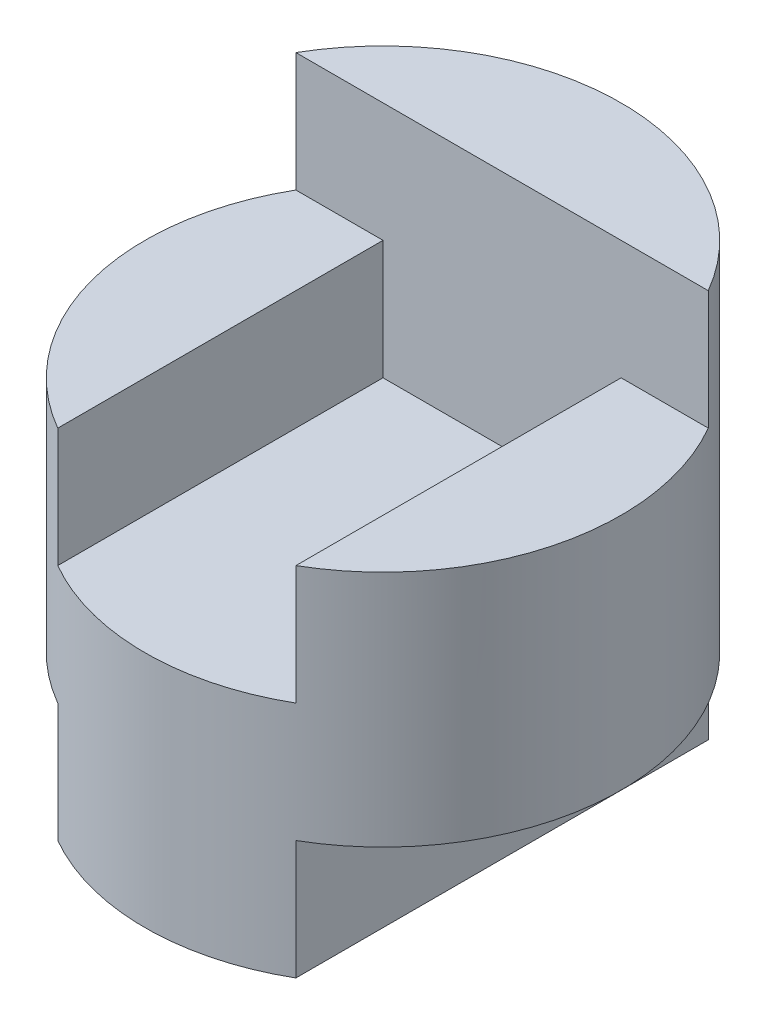
ISO-10303-21;
HEADER;
FILE_DESCRIPTION(('STEP AP214'),'2;1');
FILE_NAME('part.step','',(''),(''),'','','');
FILE_SCHEMA(('AUTOMOTIVE_DESIGN { 1 0 10303 214 1 1 1 1 }'));
ENDSEC;
DATA;
#1=APPLICATION_CONTEXT('core data for automotive mechanical design processes');
#2=APPLICATION_PROTOCOL_DEFINITION('international standard','automotive_design',2000,#1);
#3=PRODUCT_CONTEXT('',#1,'mechanical');
#4=PRODUCT('Part','Part','',(#3));
#5=PRODUCT_RELATED_PRODUCT_CATEGORY('part','',(#4));
#6=PRODUCT_DEFINITION_FORMATION('','',#4);
#7=PRODUCT_DEFINITION_CONTEXT('part definition',#1,'design');
#8=PRODUCT_DEFINITION('design','',#6,#7);
#9=PRODUCT_DEFINITION_SHAPE('','',#8);
#10=(LENGTH_UNIT() NAMED_UNIT(*) SI_UNIT(.MILLI.,.METRE.));
#11=(NAMED_UNIT(*) PLANE_ANGLE_UNIT() SI_UNIT($,.RADIAN.));
#12=(NAMED_UNIT(*) SI_UNIT($,.STERADIAN.) SOLID_ANGLE_UNIT());
#13=UNCERTAINTY_MEASURE_WITH_UNIT(LENGTH_MEASURE(1.E-05),#10,'distance_accuracy_value','');
#14=(GEOMETRIC_REPRESENTATION_CONTEXT(3) GLOBAL_UNCERTAINTY_ASSIGNED_CONTEXT((#13)) GLOBAL_UNIT_ASSIGNED_CONTEXT((#10,
#11,#12)) REPRESENTATION_CONTEXT('',''));
#15=CARTESIAN_POINT('',(0.,0.,0.));
#16=DIRECTION('',(0.,0.,1.));
#17=DIRECTION('',(1.,0.,0.));
#18=AXIS2_PLACEMENT_3D('',#15,#16,#17);
#19=CARTESIAN_POINT('',(0.,4.,0.));
#20=DIRECTION('',(0.,-1.,0.));
#21=DIRECTION('',(0.,0.,-1.));
#22=AXIS2_PLACEMENT_3D('',#19,#20,#21);
#23=CYLINDRICAL_SURFACE('',#22,2.);
#24=CARTESIAN_POINT('',(0.,1.,0.));
#25=DIRECTION('',(0.,1.,0.));
#26=DIRECTION('',(0.,0.,1.));
#27=AXIS2_PLACEMENT_3D('',#24,#25,#26);
#28=CIRCLE('',#27,2.);
#29=CARTESIAN_POINT('',(-1.,1.,-1.73205080756888));
#30=VERTEX_POINT('',#29);
#31=CARTESIAN_POINT('',(-1.,1.,1.73205080756888));
#32=VERTEX_POINT('',#31);
#33=EDGE_CURVE('E178',#30,#32,#28,.T.);
#34=ORIENTED_EDGE('',*,*,#33,.T.);
#35=DIRECTION('',(0.,-1.,0.));
#36=VECTOR('',#35,1.);
#37=CARTESIAN_POINT('',(-1.,4.,1.73205080756888));
#38=LINE('',#37,#36);
#39=CARTESIAN_POINT('',(-1.,0.,1.73205080756888));
#40=VERTEX_POINT('',#39);
#41=EDGE_CURVE('E160',#32,#40,#38,.T.);
#42=ORIENTED_EDGE('',*,*,#41,.T.);
#43=CARTESIAN_POINT('',(0.,0.,0.));
#44=DIRECTION('',(0.,1.,0.));
#45=DIRECTION('',(0.,0.,1.));
#46=AXIS2_PLACEMENT_3D('',#43,#44,#45);
#47=CIRCLE('',#46,2.);
#48=CARTESIAN_POINT('',(1.,0.,1.73205080756888));
#49=VERTEX_POINT('',#48);
#50=EDGE_CURVE('E163',#40,#49,#47,.T.);
#51=ORIENTED_EDGE('',*,*,#50,.T.);
#52=DIRECTION('',(0.,-1.,0.));
#53=VECTOR('',#52,1.);
#54=CARTESIAN_POINT('',(1.,4.,1.73205080756888));
#55=LINE('',#54,#53);
#56=CARTESIAN_POINT('',(1.,1.,1.73205080756888));
#57=VERTEX_POINT('',#56);
#58=EDGE_CURVE('E151',#49,#57,#55,.F.);
#59=ORIENTED_EDGE('',*,*,#58,.T.);
#60=CARTESIAN_POINT('',(0.,1.,0.));
#61=DIRECTION('',(0.,1.,0.));
#62=DIRECTION('',(0.,0.,1.));
#63=AXIS2_PLACEMENT_3D('',#60,#61,#62);
#64=CIRCLE('',#63,2.);
#65=CARTESIAN_POINT('',(1.,1.,-1.73205080756888));
#66=VERTEX_POINT('',#65);
#67=EDGE_CURVE('E175',#57,#66,#64,.T.);
#68=ORIENTED_EDGE('',*,*,#67,.T.);
#69=DIRECTION('',(0.,-1.,0.));
#70=VECTOR('',#69,1.);
#71=CARTESIAN_POINT('',(1.,4.,-1.73205080756888));
#72=LINE('',#71,#70);
#73=CARTESIAN_POINT('',(1.,0.,-1.73205080756888));
#74=VERTEX_POINT('',#73);
#75=EDGE_CURVE('E156',#66,#74,#72,.T.);
#76=ORIENTED_EDGE('',*,*,#75,.T.);
#77=CARTESIAN_POINT('',(-1.,0.,-1.73205080756888));
#78=VERTEX_POINT('',#77);
#79=EDGE_CURVE('E168',#74,#78,#47,.T.);
#80=ORIENTED_EDGE('',*,*,#79,.T.);
#81=DIRECTION('',(0.,-1.,0.));
#82=VECTOR('',#81,1.);
#83=CARTESIAN_POINT('',(-1.,4.,-1.73205080756888));
#84=LINE('',#83,#82);
#85=EDGE_CURVE('E55',#78,#30,#84,.F.);
#86=ORIENTED_EDGE('',*,*,#85,.T.);
#87=EDGE_LOOP('',(#34,#42,#51,#59,#68,#76,#80,#86));
#88=FACE_BOUND('',#87,.T.);
#89=DIRECTION('',(0.,-1.,0.));
#90=VECTOR('',#89,1.);
#91=CARTESIAN_POINT('',(1.73205080756888,4.,-1.));
#92=LINE('',#91,#90);
#93=CARTESIAN_POINT('',(1.73205080756888,4.,-1.));
#94=VERTEX_POINT('',#93);
#95=CARTESIAN_POINT('',(1.73205080756888,3.,-1.));
#96=VERTEX_POINT('',#95);
#97=EDGE_CURVE('E47',#94,#96,#92,.T.);
#98=ORIENTED_EDGE('',*,*,#97,.T.);
#99=CARTESIAN_POINT('',(0.,3.,0.));
#100=DIRECTION('',(0.,1.,0.));
#101=DIRECTION('',(0.,0.,1.));
#102=AXIS2_PLACEMENT_3D('',#99,#100,#101);
#103=CIRCLE('',#102,2.);
#104=CARTESIAN_POINT('',(1.,3.,1.73205080756888));
#105=VERTEX_POINT('',#104);
#106=EDGE_CURVE('E11',#105,#96,#103,.T.);
#107=ORIENTED_EDGE('',*,*,#106,.F.);
#108=DIRECTION('',(0.,-1.,0.));
#109=VECTOR('',#108,1.);
#110=CARTESIAN_POINT('',(1.,4.,1.73205080756888));
#111=LINE('',#110,#109);
#112=CARTESIAN_POINT('',(1.,2.,1.73205080756888));
#113=VERTEX_POINT('',#112);
#114=EDGE_CURVE('E40',#113,#105,#111,.F.);
#115=ORIENTED_EDGE('',*,*,#114,.F.);
#116=CARTESIAN_POINT('',(0.,2.,0.));
#117=DIRECTION('',(0.,1.,0.));
#118=DIRECTION('',(-1.,0.,0.));
#119=AXIS2_PLACEMENT_3D('',#116,#117,#118);
#120=CIRCLE('',#119,2.);
#121=CARTESIAN_POINT('',(-1.,2.,1.73205080756888));
#122=VERTEX_POINT('',#121);
#123=EDGE_CURVE('E185',#122,#113,#120,.T.);
#124=ORIENTED_EDGE('',*,*,#123,.F.);
#125=DIRECTION('',(0.,-1.,0.));
#126=VECTOR('',#125,1.);
#127=CARTESIAN_POINT('',(-1.,4.,1.73205080756888));
#128=LINE('',#127,#126);
#129=CARTESIAN_POINT('',(-1.,3.,1.73205080756888));
#130=VERTEX_POINT('',#129);
#131=EDGE_CURVE('E183',#130,#122,#128,.T.);
#132=ORIENTED_EDGE('',*,*,#131,.F.);
#133=CARTESIAN_POINT('',(0.,3.,0.));
#134=DIRECTION('',(0.,1.,0.));
#135=DIRECTION('',(-1.,0.,0.));
#136=AXIS2_PLACEMENT_3D('',#133,#134,#135);
#137=CIRCLE('',#136,2.);
#138=CARTESIAN_POINT('',(-1.73205080756888,3.,-1.));
#139=VERTEX_POINT('',#138);
#140=EDGE_CURVE('E115',#139,#130,#137,.T.);
#141=ORIENTED_EDGE('',*,*,#140,.F.);
#142=DIRECTION('',(0.,-1.,0.));
#143=VECTOR('',#142,1.);
#144=CARTESIAN_POINT('',(-1.73205080756888,4.,-1.));
#145=LINE('',#144,#143);
#146=CARTESIAN_POINT('',(-1.73205080756888,4.,-1.));
#147=VERTEX_POINT('',#146);
#148=EDGE_CURVE('E119',#139,#147,#145,.F.);
#149=ORIENTED_EDGE('',*,*,#148,.T.);
#150=CARTESIAN_POINT('',(0.,4.,0.));
#151=DIRECTION('',(0.,1.,0.));
#152=DIRECTION('',(0.,0.,1.));
#153=AXIS2_PLACEMENT_3D('',#150,#151,#152);
#154=CIRCLE('',#153,2.);
#155=EDGE_CURVE('E164',#94,#147,#154,.T.);
#156=ORIENTED_EDGE('',*,*,#155,.F.);
#157=EDGE_LOOP('',(#98,#107,#115,#124,#132,#141,#149,#156));
#158=FACE_BOUND('',#157,.T.);
#159=ADVANCED_FACE('F33',(#88,#158),#23,.T.);
#160=CARTESIAN_POINT('',(0.,4.,0.));
#161=DIRECTION('',(0.,1.,0.));
#162=DIRECTION('',(0.,0.,1.));
#163=AXIS2_PLACEMENT_3D('',#160,#161,#162);
#164=PLANE('',#163);
#165=DIRECTION('',(-1.,0.,0.));
#166=VECTOR('',#165,1.);
#167=CARTESIAN_POINT('',(0.,4.,-1.));
#168=LINE('',#167,#166);
#169=EDGE_CURVE('E180',#94,#147,#168,.T.);
#170=ORIENTED_EDGE('',*,*,#169,.F.);
#171=ORIENTED_EDGE('',*,*,#155,.T.);
#172=EDGE_LOOP('',(#170,#171));
#173=FACE_BOUND('',#172,.T.);
#174=ADVANCED_FACE('F200',(#173),#164,.T.);
#175=CARTESIAN_POINT('',(0.,0.,0.));
#176=DIRECTION('',(0.,1.,0.));
#177=DIRECTION('',(0.,0.,1.));
#178=AXIS2_PLACEMENT_3D('',#175,#176,#177);
#179=PLANE('',#178);
#180=ORIENTED_EDGE('',*,*,#50,.F.);
#181=DIRECTION('',(0.,0.,-1.));
#182=VECTOR('',#181,1.);
#183=CARTESIAN_POINT('',(-1.,0.,0.));
#184=LINE('',#183,#182);
#185=EDGE_CURVE('E173',#40,#78,#184,.T.);
#186=ORIENTED_EDGE('',*,*,#185,.T.);
#187=ORIENTED_EDGE('',*,*,#79,.F.);
#188=DIRECTION('',(0.,0.,1.));
#189=VECTOR('',#188,1.);
#190=CARTESIAN_POINT('',(1.,0.,0.));
#191=LINE('',#190,#189);
#192=EDGE_CURVE('E167',#74,#49,#191,.T.);
#193=ORIENTED_EDGE('',*,*,#192,.T.);
#194=EDGE_LOOP('',(#180,#186,#187,#193));
#195=FACE_BOUND('',#194,.T.);
#196=ADVANCED_FACE('F202',(#195),#179,.F.);
#197=CARTESIAN_POINT('',(2.,1.,-2.));
#198=DIRECTION('',(0.,1.,0.));
#199=DIRECTION('',(0.,0.,1.));
#200=AXIS2_PLACEMENT_3D('',#197,#198,#199);
#201=PLANE('',#200);
#202=DIRECTION('',(0.,0.,1.));
#203=VECTOR('',#202,1.);
#204=CARTESIAN_POINT('',(1.,1.,-2.));
#205=LINE('',#204,#203);
#206=EDGE_CURVE('E147',#66,#57,#205,.T.);
#207=ORIENTED_EDGE('',*,*,#206,.F.);
#208=ORIENTED_EDGE('',*,*,#67,.F.);
#209=EDGE_LOOP('',(#207,#208));
#210=FACE_BOUND('',#209,.T.);
#211=ADVANCED_FACE('F208',(#210),#201,.F.);
#212=CARTESIAN_POINT('',(1.,0.,-2.));
#213=DIRECTION('',(-1.,0.,0.));
#214=DIRECTION('',(0.,0.,1.));
#215=AXIS2_PLACEMENT_3D('',#212,#213,#214);
#216=PLANE('',#215);
#217=ORIENTED_EDGE('',*,*,#206,.T.);
#218=ORIENTED_EDGE('',*,*,#58,.F.);
#219=ORIENTED_EDGE('',*,*,#192,.F.);
#220=ORIENTED_EDGE('',*,*,#75,.F.);
#221=EDGE_LOOP('',(#217,#218,#219,#220));
#222=FACE_BOUND('',#221,.T.);
#223=ADVANCED_FACE('F214',(#222),#216,.F.);
#224=CARTESIAN_POINT('',(-2.,1.,-2.));
#225=DIRECTION('',(0.,1.,0.));
#226=DIRECTION('',(0.,0.,1.));
#227=AXIS2_PLACEMENT_3D('',#224,#225,#226);
#228=PLANE('',#227);
#229=DIRECTION('',(0.,0.,1.));
#230=VECTOR('',#229,1.);
#231=CARTESIAN_POINT('',(-1.,1.,-2.));
#232=LINE('',#231,#230);
#233=EDGE_CURVE('E148',#30,#32,#232,.T.);
#234=ORIENTED_EDGE('',*,*,#233,.T.);
#235=ORIENTED_EDGE('',*,*,#33,.F.);
#236=EDGE_LOOP('',(#234,#235));
#237=FACE_BOUND('',#236,.T.);
#238=ADVANCED_FACE('F218',(#237),#228,.F.);
#239=CARTESIAN_POINT('',(-1.,0.,-2.));
#240=DIRECTION('',(1.,0.,0.));
#241=DIRECTION('',(0.,0.,-1.));
#242=AXIS2_PLACEMENT_3D('',#239,#240,#241);
#243=PLANE('',#242);
#244=ORIENTED_EDGE('',*,*,#233,.F.);
#245=ORIENTED_EDGE('',*,*,#85,.F.);
#246=ORIENTED_EDGE('',*,*,#185,.F.);
#247=ORIENTED_EDGE('',*,*,#41,.F.);
#248=EDGE_LOOP('',(#244,#245,#246,#247));
#249=FACE_BOUND('',#248,.T.);
#250=ADVANCED_FACE('F220',(#249),#243,.F.);
#251=CARTESIAN_POINT('',(-1.,3.,4.));
#252=DIRECTION('',(0.,1.,0.));
#253=DIRECTION('',(-1.,0.,0.));
#254=AXIS2_PLACEMENT_3D('',#251,#252,#253);
#255=PLANE('',#254);
#256=ORIENTED_EDGE('',*,*,#140,.T.);
#257=DIRECTION('',(0.,0.,-1.));
#258=VECTOR('',#257,1.);
#259=CARTESIAN_POINT('',(-1.,3.,4.));
#260=LINE('',#259,#258);
#261=CARTESIAN_POINT('',(-1.,3.,-1.));
#262=VERTEX_POINT('',#261);
#263=EDGE_CURVE('E110',#130,#262,#260,.T.);
#264=ORIENTED_EDGE('',*,*,#263,.T.);
#265=DIRECTION('',(1.,0.,0.));
#266=VECTOR('',#265,1.);
#267=CARTESIAN_POINT('',(-1.,3.,-1.));
#268=LINE('',#267,#266);
#269=EDGE_CURVE('E113',#139,#262,#268,.T.);
#270=ORIENTED_EDGE('',*,*,#269,.F.);
#271=EDGE_LOOP('',(#256,#264,#270));
#272=FACE_BOUND('',#271,.T.);
#273=ADVANCED_FACE('F112',(#272),#255,.T.);
#274=CARTESIAN_POINT('',(-1.,2.,4.));
#275=DIRECTION('',(1.,0.,0.));
#276=DIRECTION('',(0.,1.,0.));
#277=AXIS2_PLACEMENT_3D('',#274,#275,#276);
#278=PLANE('',#277);
#279=ORIENTED_EDGE('',*,*,#131,.T.);
#280=DIRECTION('',(0.,0.,-1.));
#281=VECTOR('',#280,1.);
#282=CARTESIAN_POINT('',(-1.,2.,4.));
#283=LINE('',#282,#281);
#284=CARTESIAN_POINT('',(-1.,2.,-1.));
#285=VERTEX_POINT('',#284);
#286=EDGE_CURVE('E120',#122,#285,#283,.T.);
#287=ORIENTED_EDGE('',*,*,#286,.T.);
#288=DIRECTION('',(0.,-1.,0.));
#289=VECTOR('',#288,1.);
#290=CARTESIAN_POINT('',(-1.,2.,-1.));
#291=LINE('',#290,#289);
#292=EDGE_CURVE('E125',#262,#285,#291,.T.);
#293=ORIENTED_EDGE('',*,*,#292,.F.);
#294=ORIENTED_EDGE('',*,*,#263,.F.);
#295=EDGE_LOOP('',(#279,#287,#293,#294));
#296=FACE_BOUND('',#295,.T.);
#297=ADVANCED_FACE('F128',(#296),#278,.T.);
#298=CARTESIAN_POINT('',(1.,2.,4.));
#299=DIRECTION('',(0.,1.,0.));
#300=DIRECTION('',(-1.,0.,0.));
#301=AXIS2_PLACEMENT_3D('',#298,#299,#300);
#302=PLANE('',#301);
#303=ORIENTED_EDGE('',*,*,#123,.T.);
#304=DIRECTION('',(0.,0.,-1.));
#305=VECTOR('',#304,1.);
#306=CARTESIAN_POINT('',(1.,2.,4.));
#307=LINE('',#306,#305);
#308=CARTESIAN_POINT('',(1.,2.,-1.));
#309=VERTEX_POINT('',#308);
#310=EDGE_CURVE('E142',#113,#309,#307,.T.);
#311=ORIENTED_EDGE('',*,*,#310,.T.);
#312=DIRECTION('',(1.,0.,0.));
#313=VECTOR('',#312,1.);
#314=CARTESIAN_POINT('',(1.,2.,-1.));
#315=LINE('',#314,#313);
#316=EDGE_CURVE('E131',#285,#309,#315,.T.);
#317=ORIENTED_EDGE('',*,*,#316,.F.);
#318=ORIENTED_EDGE('',*,*,#286,.F.);
#319=EDGE_LOOP('',(#303,#311,#317,#318));
#320=FACE_BOUND('',#319,.T.);
#321=ADVANCED_FACE('F230',(#320),#302,.T.);
#322=CARTESIAN_POINT('',(1.,3.,4.));
#323=DIRECTION('',(-1.,0.,0.));
#324=DIRECTION('',(0.,-1.,0.));
#325=AXIS2_PLACEMENT_3D('',#322,#323,#324);
#326=PLANE('',#325);
#327=ORIENTED_EDGE('',*,*,#114,.T.);
#328=DIRECTION('',(0.,0.,-1.));
#329=VECTOR('',#328,1.);
#330=CARTESIAN_POINT('',(1.,3.,4.));
#331=LINE('',#330,#329);
#332=CARTESIAN_POINT('',(1.,3.,-1.));
#333=VERTEX_POINT('',#332);
#334=EDGE_CURVE('E140',#105,#333,#331,.T.);
#335=ORIENTED_EDGE('',*,*,#334,.T.);
#336=DIRECTION('',(0.,1.,0.));
#337=VECTOR('',#336,1.);
#338=CARTESIAN_POINT('',(1.,3.,-1.));
#339=LINE('',#338,#337);
#340=EDGE_CURVE('E133',#309,#333,#339,.T.);
#341=ORIENTED_EDGE('',*,*,#340,.F.);
#342=ORIENTED_EDGE('',*,*,#310,.F.);
#343=EDGE_LOOP('',(#327,#335,#341,#342));
#344=FACE_BOUND('',#343,.T.);
#345=ADVANCED_FACE('F190',(#344),#326,.T.);
#346=CARTESIAN_POINT('',(2.,3.,4.));
#347=DIRECTION('',(0.,1.,0.));
#348=DIRECTION('',(0.,0.,1.));
#349=AXIS2_PLACEMENT_3D('',#346,#347,#348);
#350=PLANE('',#349);
#351=ORIENTED_EDGE('',*,*,#106,.T.);
#352=DIRECTION('',(1.,0.,0.));
#353=VECTOR('',#352,1.);
#354=CARTESIAN_POINT('',(2.,3.,-1.));
#355=LINE('',#354,#353);
#356=EDGE_CURVE('E138',#333,#96,#355,.T.);
#357=ORIENTED_EDGE('',*,*,#356,.F.);
#358=ORIENTED_EDGE('',*,*,#334,.F.);
#359=EDGE_LOOP('',(#351,#357,#358));
#360=FACE_BOUND('',#359,.T.);
#361=ADVANCED_FACE('F197',(#360),#350,.T.);
#362=CARTESIAN_POINT('',(0.,0.,-1.));
#363=DIRECTION('',(0.,0.,-1.));
#364=DIRECTION('',(-1.,0.,0.));
#365=AXIS2_PLACEMENT_3D('',#362,#363,#364);
#366=PLANE('',#365);
#367=ORIENTED_EDGE('',*,*,#169,.T.);
#368=ORIENTED_EDGE('',*,*,#148,.F.);
#369=ORIENTED_EDGE('',*,*,#269,.T.);
#370=ORIENTED_EDGE('',*,*,#292,.T.);
#371=ORIENTED_EDGE('',*,*,#316,.T.);
#372=ORIENTED_EDGE('',*,*,#340,.T.);
#373=ORIENTED_EDGE('',*,*,#356,.T.);
#374=ORIENTED_EDGE('',*,*,#97,.F.);
#375=EDGE_LOOP('',(#367,#368,#369,#370,#371,#372,#373,#374));
#376=FACE_BOUND('',#375,.T.);
#377=ADVANCED_FACE('F123',(#376),#366,.F.);
#378=CLOSED_SHELL('',(#159,#174,#196,#211,#223,#238,#250,#273,#297,#321,#345,#361,#377));
#379=MANIFOLD_SOLID_BREP('B2',#378);
#380=ADVANCED_BREP_SHAPE_REPRESENTATION('',(#18,#379),#14);
#381=SHAPE_DEFINITION_REPRESENTATION(#9,#380);
ENDSEC;
END-ISO-10303-21;
